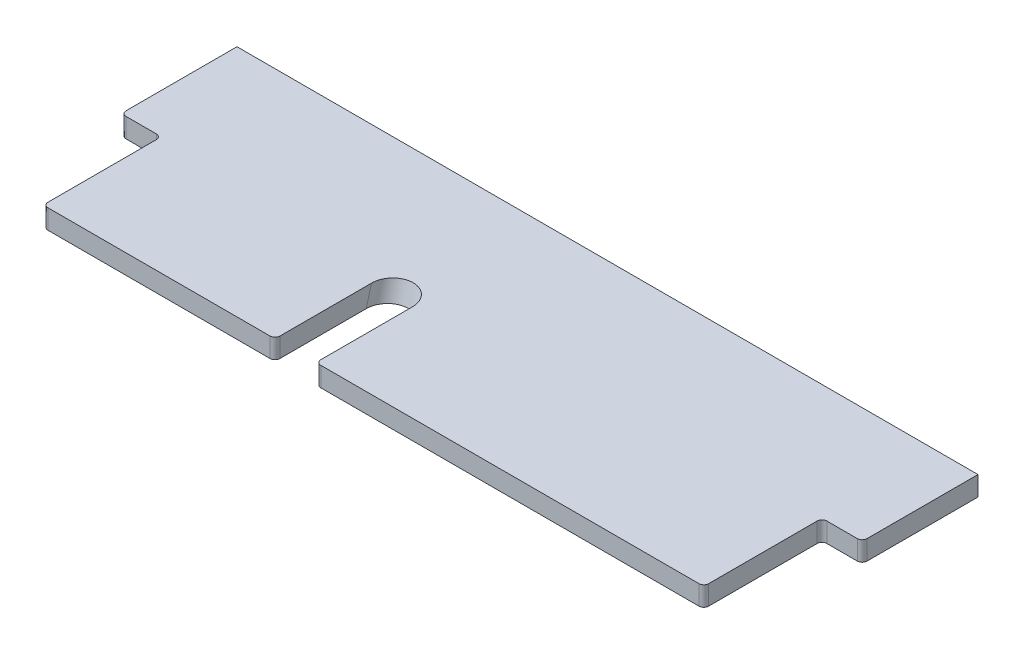
ISO-10303-21;
HEADER;
FILE_DESCRIPTION(('STEP AP214'),'2;1');
FILE_NAME('part.step','',(''),(''),'','','');
FILE_SCHEMA(('AUTOMOTIVE_DESIGN { 1 0 10303 214 1 1 1 1 }'));
ENDSEC;
DATA;
#1=APPLICATION_CONTEXT('core data for automotive mechanical design processes');
#2=APPLICATION_PROTOCOL_DEFINITION('international standard','automotive_design',2000,#1);
#3=PRODUCT_CONTEXT('',#1,'mechanical');
#4=PRODUCT('Part','Part','',(#3));
#5=PRODUCT_RELATED_PRODUCT_CATEGORY('part','',(#4));
#6=PRODUCT_DEFINITION_FORMATION('','',#4);
#7=PRODUCT_DEFINITION_CONTEXT('part definition',#1,'design');
#8=PRODUCT_DEFINITION('design','',#6,#7);
#9=PRODUCT_DEFINITION_SHAPE('','',#8);
#10=(LENGTH_UNIT() NAMED_UNIT(*) SI_UNIT(.MILLI.,.METRE.));
#11=(NAMED_UNIT(*) PLANE_ANGLE_UNIT() SI_UNIT($,.RADIAN.));
#12=(NAMED_UNIT(*) SI_UNIT($,.STERADIAN.) SOLID_ANGLE_UNIT());
#13=UNCERTAINTY_MEASURE_WITH_UNIT(LENGTH_MEASURE(1.E-05),#10,'distance_accuracy_value','');
#14=(GEOMETRIC_REPRESENTATION_CONTEXT(3) GLOBAL_UNCERTAINTY_ASSIGNED_CONTEXT((#13)) GLOBAL_UNIT_ASSIGNED_CONTEXT((#10,
#11,#12)) REPRESENTATION_CONTEXT('',''));
#15=CARTESIAN_POINT('',(0.,0.,0.));
#16=DIRECTION('',(0.,0.,1.));
#17=DIRECTION('',(1.,0.,0.));
#18=AXIS2_PLACEMENT_3D('',#15,#16,#17);
#19=CARTESIAN_POINT('',(-215.9,6.35,76.2));
#20=DIRECTION('',(0.,0.,-1.));
#21=DIRECTION('',(-1.,0.,0.));
#22=AXIS2_PLACEMENT_3D('',#19,#20,#21);
#23=PLANE('',#22);
#24=DIRECTION('',(1.,0.,0.));
#25=VECTOR('',#24,1.);
#26=CARTESIAN_POINT('',(-215.9,-6.35,76.2));
#27=LINE('',#26,#25);
#28=CARTESIAN_POINT('',(-211.963,-6.35,76.2));
#29=VERTEX_POINT('',#28);
#30=CARTESIAN_POINT('',(-67.31,-6.35,76.2));
#31=VERTEX_POINT('',#30);
#32=EDGE_CURVE('E289',#29,#31,#27,.T.);
#33=ORIENTED_EDGE('',*,*,#32,.T.);
#34=DIRECTION('',(0.,-1.,0.));
#35=VECTOR('',#34,1.);
#36=CARTESIAN_POINT('',(-67.31,6.35,76.2));
#37=LINE('',#36,#35);
#38=CARTESIAN_POINT('',(-67.31,6.35,76.2));
#39=VERTEX_POINT('',#38);
#40=EDGE_CURVE('E317',#31,#39,#37,.F.);
#41=ORIENTED_EDGE('',*,*,#40,.T.);
#42=DIRECTION('',(1.,0.,0.));
#43=VECTOR('',#42,1.);
#44=CARTESIAN_POINT('',(-215.9,6.35,76.2));
#45=LINE('',#44,#43);
#46=CARTESIAN_POINT('',(-211.963,6.35,76.2));
#47=VERTEX_POINT('',#46);
#48=EDGE_CURVE('E225',#47,#39,#45,.T.);
#49=ORIENTED_EDGE('',*,*,#48,.F.);
#50=DIRECTION('',(0.,-1.,0.));
#51=VECTOR('',#50,1.);
#52=CARTESIAN_POINT('',(-211.963,6.35,76.2));
#53=LINE('',#52,#51);
#54=EDGE_CURVE('E313',#47,#29,#53,.T.);
#55=ORIENTED_EDGE('',*,*,#54,.T.);
#56=EDGE_LOOP('',(#33,#41,#49,#55));
#57=FACE_BOUND('',#56,.T.);
#58=ADVANCED_FACE('F44',(#57),#23,.F.);
#59=CARTESIAN_POINT('',(215.138,6.35,0.));
#60=DIRECTION('',(-1.,0.,0.));
#61=DIRECTION('',(0.,0.,1.));
#62=AXIS2_PLACEMENT_3D('',#59,#60,#61);
#63=PLANE('',#62);
#64=DIRECTION('',(0.,0.,-1.));
#65=VECTOR('',#64,1.);
#66=CARTESIAN_POINT('',(215.138,-6.35,0.));
#67=LINE('',#66,#65);
#68=CARTESIAN_POINT('',(215.138,-6.35,73.025));
#69=VERTEX_POINT('',#68);
#70=CARTESIAN_POINT('',(215.138,-6.35,2.41300000000001));
#71=VERTEX_POINT('',#70);
#72=EDGE_CURVE('E237',#69,#71,#67,.T.);
#73=ORIENTED_EDGE('',*,*,#72,.T.);
#74=DIRECTION('',(0.,-1.,0.));
#75=VECTOR('',#74,1.);
#76=CARTESIAN_POINT('',(215.138,6.35,2.41300000000001));
#77=LINE('',#76,#75);
#78=CARTESIAN_POINT('',(215.138,6.35,2.41300000000001));
#79=VERTEX_POINT('',#78);
#80=EDGE_CURVE('E369',#71,#79,#77,.F.);
#81=ORIENTED_EDGE('',*,*,#80,.T.);
#82=DIRECTION('',(0.,0.,-1.));
#83=VECTOR('',#82,1.);
#84=CARTESIAN_POINT('',(215.138,6.35,0.));
#85=LINE('',#84,#83);
#86=CARTESIAN_POINT('',(215.138,6.35,73.025));
#87=VERTEX_POINT('',#86);
#88=EDGE_CURVE('E242',#87,#79,#85,.T.);
#89=ORIENTED_EDGE('',*,*,#88,.F.);
#90=DIRECTION('',(0.,-1.,0.));
#91=VECTOR('',#90,1.);
#92=CARTESIAN_POINT('',(215.138,6.35,73.025));
#93=LINE('',#92,#91);
#94=EDGE_CURVE('E365',#87,#69,#93,.T.);
#95=ORIENTED_EDGE('',*,*,#94,.T.);
#96=EDGE_LOOP('',(#73,#81,#89,#95));
#97=FACE_BOUND('',#96,.T.);
#98=ADVANCED_FACE('F425',(#97),#63,.F.);
#99=CARTESIAN_POINT('',(215.9,6.35,-0.761999999999986));
#100=DIRECTION('',(0.,0.,-1.));
#101=DIRECTION('',(-1.,0.,0.));
#102=AXIS2_PLACEMENT_3D('',#99,#100,#101);
#103=PLANE('',#102);
#104=DIRECTION('',(1.,0.,0.));
#105=VECTOR('',#104,1.);
#106=CARTESIAN_POINT('',(215.9,-6.35,-0.761999999999986));
#107=LINE('',#106,#105);
#108=CARTESIAN_POINT('',(218.313,-6.35,-0.761999999999986));
#109=VERTEX_POINT('',#108);
#110=CARTESIAN_POINT('',(238.125,-6.35,-0.761999999999986));
#111=VERTEX_POINT('',#110);
#112=EDGE_CURVE('E220',#109,#111,#107,.T.);
#113=ORIENTED_EDGE('',*,*,#112,.T.);
#114=DIRECTION('',(0.,-1.,0.));
#115=VECTOR('',#114,1.);
#116=CARTESIAN_POINT('',(238.125,6.35,-0.761999999999986));
#117=LINE('',#116,#115);
#118=CARTESIAN_POINT('',(238.125,6.35,-0.761999999999986));
#119=VERTEX_POINT('',#118);
#120=EDGE_CURVE('E362',#111,#119,#117,.F.);
#121=ORIENTED_EDGE('',*,*,#120,.T.);
#122=DIRECTION('',(1.,0.,0.));
#123=VECTOR('',#122,1.);
#124=CARTESIAN_POINT('',(215.9,6.35,-0.761999999999986));
#125=LINE('',#124,#123);
#126=CARTESIAN_POINT('',(218.313,6.35,-0.761999999999986));
#127=VERTEX_POINT('',#126);
#128=EDGE_CURVE('E236',#127,#119,#125,.T.);
#129=ORIENTED_EDGE('',*,*,#128,.F.);
#130=DIRECTION('',(0.,-1.,0.));
#131=VECTOR('',#130,1.);
#132=CARTESIAN_POINT('',(218.313,-6.35,-0.761999999999986));
#133=LINE('',#132,#131);
#134=EDGE_CURVE('E358',#127,#109,#133,.T.);
#135=ORIENTED_EDGE('',*,*,#134,.T.);
#136=EDGE_LOOP('',(#113,#121,#129,#135));
#137=FACE_BOUND('',#136,.T.);
#138=ADVANCED_FACE('F434',(#137),#103,.F.);
#139=CARTESIAN_POINT('',(241.3,6.35,-76.2));
#140=DIRECTION('',(-1.,0.,0.));
#141=DIRECTION('',(0.,0.,1.));
#142=AXIS2_PLACEMENT_3D('',#139,#140,#141);
#143=PLANE('',#142);
#144=DIRECTION('',(0.,0.,-1.));
#145=VECTOR('',#144,1.);
#146=CARTESIAN_POINT('',(241.3,6.35,-76.2));
#147=LINE('',#146,#145);
#148=CARTESIAN_POINT('',(241.3,6.35,-3.93700000000001));
#149=VERTEX_POINT('',#148);
#150=CARTESIAN_POINT('',(241.3,6.35,-76.2));
#151=VERTEX_POINT('',#150);
#152=EDGE_CURVE('E233',#149,#151,#147,.T.);
#153=ORIENTED_EDGE('',*,*,#152,.F.);
#154=DIRECTION('',(0.,-1.,0.));
#155=VECTOR('',#154,1.);
#156=CARTESIAN_POINT('',(241.3,6.35,-3.93699999999998));
#157=LINE('',#156,#155);
#158=CARTESIAN_POINT('',(241.3,-6.35,-3.93700000000001));
#159=VERTEX_POINT('',#158);
#160=EDGE_CURVE('E354',#149,#159,#157,.T.);
#161=ORIENTED_EDGE('',*,*,#160,.T.);
#162=DIRECTION('',(0.,0.,-1.));
#163=VECTOR('',#162,1.);
#164=CARTESIAN_POINT('',(241.3,-6.35,-76.2));
#165=LINE('',#164,#163);
#166=CARTESIAN_POINT('',(241.3,-6.35,-76.2));
#167=VERTEX_POINT('',#166);
#168=EDGE_CURVE('E195',#159,#167,#165,.T.);
#169=ORIENTED_EDGE('',*,*,#168,.T.);
#170=DIRECTION('',(0.,-1.,0.));
#171=VECTOR('',#170,1.);
#172=CARTESIAN_POINT('',(241.3,6.35,-76.2));
#173=LINE('',#172,#171);
#174=EDGE_CURVE('E190',#151,#167,#173,.T.);
#175=ORIENTED_EDGE('',*,*,#174,.F.);
#176=EDGE_LOOP('',(#153,#161,#169,#175));
#177=FACE_BOUND('',#176,.T.);
#178=ADVANCED_FACE('F442',(#177),#143,.F.);
#179=CARTESIAN_POINT('',(-215.9,6.35,-76.2));
#180=DIRECTION('',(0.,0.,1.));
#181=DIRECTION('',(1.,0.,0.));
#182=AXIS2_PLACEMENT_3D('',#179,#180,#181);
#183=PLANE('',#182);
#184=DIRECTION('',(-1.,0.,0.));
#185=VECTOR('',#184,1.);
#186=CARTESIAN_POINT('',(-215.9,-6.35,-76.2));
#187=LINE('',#186,#185);
#188=CARTESIAN_POINT('',(-241.3,-6.35,-76.2));
#189=VERTEX_POINT('',#188);
#190=EDGE_CURVE('E183',#167,#189,#187,.T.);
#191=ORIENTED_EDGE('',*,*,#190,.T.);
#192=DIRECTION('',(0.,-1.,0.));
#193=VECTOR('',#192,1.);
#194=CARTESIAN_POINT('',(-241.3,6.35,-76.2));
#195=LINE('',#194,#193);
#196=CARTESIAN_POINT('',(-241.3,6.35,-76.2));
#197=VERTEX_POINT('',#196);
#198=EDGE_CURVE('E187',#197,#189,#195,.T.);
#199=ORIENTED_EDGE('',*,*,#198,.F.);
#200=DIRECTION('',(-1.,0.,0.));
#201=VECTOR('',#200,1.);
#202=CARTESIAN_POINT('',(215.9,6.35,-76.2));
#203=LINE('',#202,#201);
#204=EDGE_CURVE('E230',#151,#197,#203,.T.);
#205=ORIENTED_EDGE('',*,*,#204,.F.);
#206=ORIENTED_EDGE('',*,*,#174,.T.);
#207=EDGE_LOOP('',(#191,#199,#205,#206));
#208=FACE_BOUND('',#207,.T.);
#209=ADVANCED_FACE('F185',(#208),#183,.F.);
#210=CARTESIAN_POINT('',(-241.3,6.35,-76.2));
#211=DIRECTION('',(1.,0.,0.));
#212=DIRECTION('',(0.,0.,-1.));
#213=AXIS2_PLACEMENT_3D('',#210,#211,#212);
#214=PLANE('',#213);
#215=DIRECTION('',(0.,0.,1.));
#216=VECTOR('',#215,1.);
#217=CARTESIAN_POINT('',(-241.3,-6.35,-76.2));
#218=LINE('',#217,#216);
#219=CARTESIAN_POINT('',(-241.3,-6.35,-3.93700000000001));
#220=VERTEX_POINT('',#219);
#221=EDGE_CURVE('E200',#189,#220,#218,.T.);
#222=ORIENTED_EDGE('',*,*,#221,.T.);
#223=DIRECTION('',(0.,-1.,0.));
#224=VECTOR('',#223,1.);
#225=CARTESIAN_POINT('',(-241.3,6.35,-3.93699999999998));
#226=LINE('',#225,#224);
#227=CARTESIAN_POINT('',(-241.3,6.35,-3.93700000000001));
#228=VERTEX_POINT('',#227);
#229=EDGE_CURVE('E351',#220,#228,#226,.F.);
#230=ORIENTED_EDGE('',*,*,#229,.T.);
#231=DIRECTION('',(0.,0.,1.));
#232=VECTOR('',#231,1.);
#233=CARTESIAN_POINT('',(-241.3,6.35,-76.2));
#234=LINE('',#233,#232);
#235=EDGE_CURVE('E203',#197,#228,#234,.T.);
#236=ORIENTED_EDGE('',*,*,#235,.F.);
#237=ORIENTED_EDGE('',*,*,#198,.T.);
#238=EDGE_LOOP('',(#222,#230,#236,#237));
#239=FACE_BOUND('',#238,.T.);
#240=ADVANCED_FACE('F199',(#239),#214,.F.);
#241=CARTESIAN_POINT('',(-215.9,6.35,-0.76199999999999));
#242=DIRECTION('',(0.,0.,-1.));
#243=DIRECTION('',(-1.,0.,0.));
#244=AXIS2_PLACEMENT_3D('',#241,#242,#243);
#245=PLANE('',#244);
#246=DIRECTION('',(1.,0.,0.));
#247=VECTOR('',#246,1.);
#248=CARTESIAN_POINT('',(-215.9,6.35,-0.76199999999999));
#249=LINE('',#248,#247);
#250=CARTESIAN_POINT('',(-238.125,6.35,-0.761999999999987));
#251=VERTEX_POINT('',#250);
#252=CARTESIAN_POINT('',(-218.313,6.35,-0.761999999999989));
#253=VERTEX_POINT('',#252);
#254=EDGE_CURVE('E229',#251,#253,#249,.T.);
#255=ORIENTED_EDGE('',*,*,#254,.F.);
#256=DIRECTION('',(0.,-1.,0.));
#257=VECTOR('',#256,1.);
#258=CARTESIAN_POINT('',(-238.125,6.35,-0.761999999999987));
#259=LINE('',#258,#257);
#260=CARTESIAN_POINT('',(-238.125,-6.35,-0.761999999999987));
#261=VERTEX_POINT('',#260);
#262=EDGE_CURVE('E347',#251,#261,#259,.T.);
#263=ORIENTED_EDGE('',*,*,#262,.T.);
#264=DIRECTION('',(1.,0.,0.));
#265=VECTOR('',#264,1.);
#266=CARTESIAN_POINT('',(-215.9,-6.35,-0.76199999999999));
#267=LINE('',#266,#265);
#268=CARTESIAN_POINT('',(-218.313,-6.35,-0.761999999999989));
#269=VERTEX_POINT('',#268);
#270=EDGE_CURVE('E205',#261,#269,#267,.T.);
#271=ORIENTED_EDGE('',*,*,#270,.T.);
#272=DIRECTION('',(0.,-1.,0.));
#273=VECTOR('',#272,1.);
#274=CARTESIAN_POINT('',(-218.313,6.35,-0.761999999999989));
#275=LINE('',#274,#273);
#276=EDGE_CURVE('E344',#269,#253,#275,.F.);
#277=ORIENTED_EDGE('',*,*,#276,.T.);
#278=EDGE_LOOP('',(#255,#263,#271,#277));
#279=FACE_BOUND('',#278,.T.);
#280=ADVANCED_FACE('F394',(#279),#245,.F.);
#281=CARTESIAN_POINT('',(-215.138,6.35,0.));
#282=DIRECTION('',(1.,0.,0.));
#283=DIRECTION('',(0.,0.,-1.));
#284=AXIS2_PLACEMENT_3D('',#281,#282,#283);
#285=PLANE('',#284);
#286=DIRECTION('',(0.,0.,1.));
#287=VECTOR('',#286,1.);
#288=CARTESIAN_POINT('',(-215.138,-6.35,0.));
#289=LINE('',#288,#287);
#290=CARTESIAN_POINT('',(-215.138,-6.35,2.41300000000001));
#291=VERTEX_POINT('',#290);
#292=CARTESIAN_POINT('',(-215.138,-6.35,73.025));
#293=VERTEX_POINT('',#292);
#294=EDGE_CURVE('E253',#291,#293,#289,.T.);
#295=ORIENTED_EDGE('',*,*,#294,.T.);
#296=DIRECTION('',(0.,-1.,0.));
#297=VECTOR('',#296,1.);
#298=CARTESIAN_POINT('',(-215.138,6.35,73.025));
#299=LINE('',#298,#297);
#300=CARTESIAN_POINT('',(-215.138,6.35,73.025));
#301=VERTEX_POINT('',#300);
#302=EDGE_CURVE('E60',#293,#301,#299,.F.);
#303=ORIENTED_EDGE('',*,*,#302,.T.);
#304=DIRECTION('',(0.,0.,1.));
#305=VECTOR('',#304,1.);
#306=CARTESIAN_POINT('',(-215.138,6.35,0.));
#307=LINE('',#306,#305);
#308=CARTESIAN_POINT('',(-215.138,6.35,2.41300000000001));
#309=VERTEX_POINT('',#308);
#310=EDGE_CURVE('E226',#309,#301,#307,.T.);
#311=ORIENTED_EDGE('',*,*,#310,.F.);
#312=DIRECTION('',(0.,-1.,0.));
#313=VECTOR('',#312,1.);
#314=CARTESIAN_POINT('',(-215.138,-6.35,2.41300000000001));
#315=LINE('',#314,#313);
#316=EDGE_CURVE('E338',#309,#291,#315,.T.);
#317=ORIENTED_EDGE('',*,*,#316,.T.);
#318=EDGE_LOOP('',(#295,#303,#311,#317));
#319=FACE_BOUND('',#318,.T.);
#320=ADVANCED_FACE('F396',(#319),#285,.F.);
#321=CARTESIAN_POINT('',(-34.2899999999998,-6.35,76.2));
#322=VERTEX_POINT('',#321);
#323=CARTESIAN_POINT('',(211.963,-6.35,76.2));
#324=VERTEX_POINT('',#323);
#325=EDGE_CURVE('E216',#322,#324,#27,.T.);
#326=ORIENTED_EDGE('',*,*,#325,.T.);
#327=DIRECTION('',(0.,-1.,0.));
#328=VECTOR('',#327,1.);
#329=CARTESIAN_POINT('',(211.963,6.35,76.2));
#330=LINE('',#329,#328);
#331=CARTESIAN_POINT('',(211.963,6.35,76.2));
#332=VERTEX_POINT('',#331);
#333=EDGE_CURVE('E375',#324,#332,#330,.F.);
#334=ORIENTED_EDGE('',*,*,#333,.T.);
#335=CARTESIAN_POINT('',(-34.2899999999998,6.35,76.2));
#336=VERTEX_POINT('',#335);
#337=EDGE_CURVE('E221',#336,#332,#45,.T.);
#338=ORIENTED_EDGE('',*,*,#337,.F.);
#339=DIRECTION('',(0.,1.,0.));
#340=VECTOR('',#339,1.);
#341=CARTESIAN_POINT('',(-34.2899999999998,6.3500000000001,76.2));
#342=LINE('',#341,#340);
#343=EDGE_CURVE('E372',#336,#322,#342,.F.);
#344=ORIENTED_EDGE('',*,*,#343,.T.);
#345=EDGE_LOOP('',(#326,#334,#338,#344));
#346=FACE_BOUND('',#345,.T.);
#347=ADVANCED_FACE('F414',(#346),#23,.F.);
#348=CARTESIAN_POINT('',(0.,6.35,0.));
#349=DIRECTION('',(0.,1.,0.));
#350=DIRECTION('',(0.,0.,1.));
#351=AXIS2_PLACEMENT_3D('',#348,#349,#350);
#352=PLANE('',#351);
#353=ORIENTED_EDGE('',*,*,#48,.T.);
#354=CARTESIAN_POINT('',(-67.31,6.35,73.025));
#355=DIRECTION('',(0.,1.,0.));
#356=DIRECTION('',(0.,0.,1.));
#357=AXIS2_PLACEMENT_3D('',#354,#355,#356);
#358=CIRCLE('',#357,3.175);
#359=CARTESIAN_POINT('',(-64.135,6.35,73.025));
#360=VERTEX_POINT('',#359);
#361=EDGE_CURVE('E335',#39,#360,#358,.T.);
#362=ORIENTED_EDGE('',*,*,#361,.T.);
#363=DIRECTION('',(0.,0.,1.));
#364=VECTOR('',#363,1.);
#365=CARTESIAN_POINT('',(-64.135,6.35,0.));
#366=LINE('',#365,#364);
#367=CARTESIAN_POINT('',(-64.135,6.34999999999999,13.3639769330719));
#368=VERTEX_POINT('',#367);
#369=EDGE_CURVE('E265',#368,#360,#366,.T.);
#370=ORIENTED_EDGE('',*,*,#369,.F.);
#371=CARTESIAN_POINT('',(-50.7999999999986,6.34999999999999,13.3639769330719));
#372=DIRECTION('',(0.,1.,0.));
#373=DIRECTION('',(0.,0.,-1.));
#374=AXIS2_PLACEMENT_3D('',#371,#372,#373);
#375=ELLIPSE('',#374,13.8160367727838,13.3350000000001);
#376=CARTESIAN_POINT('',(-37.4649999999998,6.34999999999999,13.3639769330719));
#377=VERTEX_POINT('',#376);
#378=EDGE_CURVE('E246',#368,#377,#375,.F.);
#379=ORIENTED_EDGE('',*,*,#378,.T.);
#380=DIRECTION('',(0.,0.,1.));
#381=VECTOR('',#380,1.);
#382=CARTESIAN_POINT('',(-37.4649999999998,6.35,-76.201));
#383=LINE('',#382,#381);
#384=CARTESIAN_POINT('',(-37.4649999999998,6.35,73.025));
#385=VERTEX_POINT('',#384);
#386=EDGE_CURVE('E275',#377,#385,#383,.T.);
#387=ORIENTED_EDGE('',*,*,#386,.T.);
#388=CARTESIAN_POINT('',(-34.2899999999998,6.35,73.025));
#389=DIRECTION('',(0.,1.,0.));
#390=DIRECTION('',(0.,0.,1.));
#391=AXIS2_PLACEMENT_3D('',#388,#389,#390);
#392=CIRCLE('',#391,3.175);
#393=EDGE_CURVE('E320',#385,#336,#392,.T.);
#394=ORIENTED_EDGE('',*,*,#393,.T.);
#395=ORIENTED_EDGE('',*,*,#337,.T.);
#396=CARTESIAN_POINT('',(211.963,6.35,73.025));
#397=DIRECTION('',(0.,1.,0.));
#398=DIRECTION('',(0.,0.,1.));
#399=AXIS2_PLACEMENT_3D('',#396,#397,#398);
#400=CIRCLE('',#399,3.175);
#401=EDGE_CURVE('E323',#332,#87,#400,.T.);
#402=ORIENTED_EDGE('',*,*,#401,.T.);
#403=ORIENTED_EDGE('',*,*,#88,.T.);
#404=CARTESIAN_POINT('',(218.313,6.35,2.41300000000001));
#405=DIRECTION('',(0.,1.,0.));
#406=DIRECTION('',(0.,0.,1.));
#407=AXIS2_PLACEMENT_3D('',#404,#405,#406);
#408=CIRCLE('',#407,3.175);
#409=EDGE_CURVE('E385',#79,#127,#408,.F.);
#410=ORIENTED_EDGE('',*,*,#409,.T.);
#411=ORIENTED_EDGE('',*,*,#128,.T.);
#412=CARTESIAN_POINT('',(238.125,6.35,-3.93699999999998));
#413=DIRECTION('',(0.,1.,0.));
#414=DIRECTION('',(0.,0.,1.));
#415=AXIS2_PLACEMENT_3D('',#412,#413,#414);
#416=CIRCLE('',#415,3.175);
#417=EDGE_CURVE('E326',#119,#149,#416,.T.);
#418=ORIENTED_EDGE('',*,*,#417,.T.);
#419=ORIENTED_EDGE('',*,*,#152,.T.);
#420=ORIENTED_EDGE('',*,*,#204,.T.);
#421=ORIENTED_EDGE('',*,*,#235,.T.);
#422=CARTESIAN_POINT('',(-238.125,6.35,-3.93699999999999));
#423=DIRECTION('',(0.,1.,0.));
#424=DIRECTION('',(0.,0.,1.));
#425=AXIS2_PLACEMENT_3D('',#422,#423,#424);
#426=CIRCLE('',#425,3.175);
#427=EDGE_CURVE('E329',#228,#251,#426,.T.);
#428=ORIENTED_EDGE('',*,*,#427,.T.);
#429=ORIENTED_EDGE('',*,*,#254,.T.);
#430=CARTESIAN_POINT('',(-218.313,6.35,2.41300000000001));
#431=DIRECTION('',(0.,1.,0.));
#432=DIRECTION('',(0.,0.,1.));
#433=AXIS2_PLACEMENT_3D('',#430,#431,#432);
#434=CIRCLE('',#433,3.175);
#435=EDGE_CURVE('E12',#253,#309,#434,.F.);
#436=ORIENTED_EDGE('',*,*,#435,.T.);
#437=ORIENTED_EDGE('',*,*,#310,.T.);
#438=CARTESIAN_POINT('',(-211.963,6.35,73.025));
#439=DIRECTION('',(0.,1.,0.));
#440=DIRECTION('',(0.,0.,1.));
#441=AXIS2_PLACEMENT_3D('',#438,#439,#440);
#442=CIRCLE('',#441,3.175);
#443=EDGE_CURVE('E332',#301,#47,#442,.T.);
#444=ORIENTED_EDGE('',*,*,#443,.T.);
#445=EDGE_LOOP('',(#353,#362,#370,#379,#387,#394,#395,#402,#403,#410,#411,#418,#419,#420,#421,
#428,#429,#436,#437,#444));
#446=FACE_BOUND('',#445,.T.);
#447=ADVANCED_FACE('F399',(#446),#352,.T.);
#448=CARTESIAN_POINT('',(0.,-6.35,0.));
#449=DIRECTION('',(0.,1.,0.));
#450=DIRECTION('',(0.,0.,1.));
#451=AXIS2_PLACEMENT_3D('',#448,#449,#450);
#452=PLANE('',#451);
#453=DIRECTION('',(0.,0.,1.));
#454=VECTOR('',#453,1.);
#455=CARTESIAN_POINT('',(-64.135,-6.35,0.));
#456=LINE('',#455,#454);
#457=CARTESIAN_POINT('',(-64.135,-6.34999999999999,16.8058357235667));
#458=VERTEX_POINT('',#457);
#459=CARTESIAN_POINT('',(-64.135,-6.35,73.025));
#460=VERTEX_POINT('',#459);
#461=EDGE_CURVE('E270',#458,#460,#456,.T.);
#462=ORIENTED_EDGE('',*,*,#461,.T.);
#463=CARTESIAN_POINT('',(-67.31,-6.35,73.025));
#464=DIRECTION('',(0.,1.,0.));
#465=DIRECTION('',(0.,0.,1.));
#466=AXIS2_PLACEMENT_3D('',#463,#464,#465);
#467=CIRCLE('',#466,3.175);
#468=EDGE_CURVE('E310',#460,#31,#467,.F.);
#469=ORIENTED_EDGE('',*,*,#468,.T.);
#470=ORIENTED_EDGE('',*,*,#32,.F.);
#471=CARTESIAN_POINT('',(-211.963,-6.35,73.025));
#472=DIRECTION('',(0.,1.,0.));
#473=DIRECTION('',(0.,0.,1.));
#474=AXIS2_PLACEMENT_3D('',#471,#472,#473);
#475=CIRCLE('',#474,3.175);
#476=EDGE_CURVE('E307',#29,#293,#475,.F.);
#477=ORIENTED_EDGE('',*,*,#476,.T.);
#478=ORIENTED_EDGE('',*,*,#294,.F.);
#479=CARTESIAN_POINT('',(-218.313,-6.35,2.41300000000001));
#480=DIRECTION('',(0.,1.,0.));
#481=DIRECTION('',(0.,0.,1.));
#482=AXIS2_PLACEMENT_3D('',#479,#480,#481);
#483=CIRCLE('',#482,3.175);
#484=EDGE_CURVE('E53',#291,#269,#483,.T.);
#485=ORIENTED_EDGE('',*,*,#484,.T.);
#486=ORIENTED_EDGE('',*,*,#270,.F.);
#487=CARTESIAN_POINT('',(-238.125,-6.35,-3.93699999999999));
#488=DIRECTION('',(0.,1.,0.));
#489=DIRECTION('',(0.,0.,1.));
#490=AXIS2_PLACEMENT_3D('',#487,#488,#489);
#491=CIRCLE('',#490,3.175);
#492=EDGE_CURVE('E210',#261,#220,#491,.F.);
#493=ORIENTED_EDGE('',*,*,#492,.T.);
#494=ORIENTED_EDGE('',*,*,#221,.F.);
#495=ORIENTED_EDGE('',*,*,#190,.F.);
#496=ORIENTED_EDGE('',*,*,#168,.F.);
#497=CARTESIAN_POINT('',(238.125,-6.35,-3.93699999999998));
#498=DIRECTION('',(0.,1.,0.));
#499=DIRECTION('',(0.,0.,1.));
#500=AXIS2_PLACEMENT_3D('',#497,#498,#499);
#501=CIRCLE('',#500,3.175);
#502=EDGE_CURVE('E302',#159,#111,#501,.F.);
#503=ORIENTED_EDGE('',*,*,#502,.T.);
#504=ORIENTED_EDGE('',*,*,#112,.F.);
#505=CARTESIAN_POINT('',(218.313,-6.35,2.41300000000001));
#506=DIRECTION('',(0.,1.,0.));
#507=DIRECTION('',(0.,0.,1.));
#508=AXIS2_PLACEMENT_3D('',#505,#506,#507);
#509=CIRCLE('',#508,3.175);
#510=EDGE_CURVE('E382',#109,#71,#509,.T.);
#511=ORIENTED_EDGE('',*,*,#510,.T.);
#512=ORIENTED_EDGE('',*,*,#72,.F.);
#513=CARTESIAN_POINT('',(211.963,-6.35,73.025));
#514=DIRECTION('',(0.,1.,0.));
#515=DIRECTION('',(0.,0.,1.));
#516=AXIS2_PLACEMENT_3D('',#513,#514,#515);
#517=CIRCLE('',#516,3.175);
#518=EDGE_CURVE('E299',#69,#324,#517,.F.);
#519=ORIENTED_EDGE('',*,*,#518,.T.);
#520=ORIENTED_EDGE('',*,*,#325,.F.);
#521=CARTESIAN_POINT('',(-34.2899999999998,-6.35,73.025));
#522=DIRECTION('',(0.,1.,0.));
#523=DIRECTION('',(0.,0.,1.));
#524=AXIS2_PLACEMENT_3D('',#521,#522,#523);
#525=CIRCLE('',#524,3.175);
#526=CARTESIAN_POINT('',(-37.4649999999998,-6.35,73.025));
#527=VERTEX_POINT('',#526);
#528=EDGE_CURVE('E296',#322,#527,#525,.F.);
#529=ORIENTED_EDGE('',*,*,#528,.T.);
#530=DIRECTION('',(0.,0.,1.));
#531=VECTOR('',#530,1.);
#532=CARTESIAN_POINT('',(-37.4649999999998,-6.35,-76.201));
#533=LINE('',#532,#531);
#534=CARTESIAN_POINT('',(-37.4649999999998,-6.34999999999999,16.8058357235667));
#535=VERTEX_POINT('',#534);
#536=EDGE_CURVE('E271',#535,#527,#533,.T.);
#537=ORIENTED_EDGE('',*,*,#536,.F.);
#538=CARTESIAN_POINT('',(-50.7999999999986,-6.34999999999999,16.8058357235667));
#539=DIRECTION('',(0.,1.,0.));
#540=DIRECTION('',(0.,0.,-1.));
#541=AXIS2_PLACEMENT_3D('',#538,#539,#540);
#542=ELLIPSE('',#541,13.8160367727838,13.3350000000001);
#543=EDGE_CURVE('E276',#458,#535,#542,.F.);
#544=ORIENTED_EDGE('',*,*,#543,.F.);
#545=EDGE_LOOP('',(#462,#469,#470,#477,#478,#485,#486,#493,#494,#495,#496,#503,#504,#511,#512,
#519,#520,#529,#537,#544));
#546=FACE_BOUND('',#545,.T.);
#547=ADVANCED_FACE('F208',(#546),#452,.F.);
#548=CARTESIAN_POINT('',(-50.7999999999986,-171.450000000005,61.5499999999998));
#549=DIRECTION('',(0.,0.965182723476006,-0.261576585923588));
#550=DIRECTION('',(0.,-0.261576585923588,-0.965182723476006));
#551=AXIS2_PLACEMENT_3D('',#548,#549,#550);
#552=CYLINDRICAL_SURFACE('',#551,13.3350000000001);
#553=DIRECTION('',(0.,0.965182723476006,-0.261576585923588));
#554=VECTOR('',#553,1.);
#555=CARTESIAN_POINT('',(-64.1349999999987,-171.450000000005,61.5499999999998));
#556=LINE('',#555,#554);
#557=EDGE_CURVE('E266',#368,#458,#556,.F.);
#558=ORIENTED_EDGE('',*,*,#557,.T.);
#559=ORIENTED_EDGE('',*,*,#543,.T.);
#560=DIRECTION('',(0.,0.965182723476006,-0.261576585923588));
#561=VECTOR('',#560,1.);
#562=CARTESIAN_POINT('',(-37.4649999999985,-171.450000000005,61.5499999999998));
#563=LINE('',#562,#561);
#564=EDGE_CURVE('E241',#377,#535,#563,.F.);
#565=ORIENTED_EDGE('',*,*,#564,.F.);
#566=ORIENTED_EDGE('',*,*,#378,.F.);
#567=EDGE_LOOP('',(#558,#559,#565,#566));
#568=FACE_BOUND('',#567,.T.);
#569=ADVANCED_FACE('F480',(#568),#552,.F.);
#570=CARTESIAN_POINT('',(-37.4649999999998,6.34999999999999,-76.201));
#571=DIRECTION('',(1.,0.,0.));
#572=DIRECTION('',(0.,1.,0.));
#573=AXIS2_PLACEMENT_3D('',#570,#571,#572);
#574=PLANE('',#573);
#575=ORIENTED_EDGE('',*,*,#536,.T.);
#576=DIRECTION('',(0.,1.,0.));
#577=VECTOR('',#576,1.);
#578=CARTESIAN_POINT('',(-37.4649999999998,6.34999999999999,73.025));
#579=LINE('',#578,#577);
#580=EDGE_CURVE('E378',#527,#385,#579,.T.);
#581=ORIENTED_EDGE('',*,*,#580,.T.);
#582=ORIENTED_EDGE('',*,*,#386,.F.);
#583=ORIENTED_EDGE('',*,*,#564,.T.);
#584=EDGE_LOOP('',(#575,#581,#582,#583));
#585=FACE_BOUND('',#584,.T.);
#586=ADVANCED_FACE('F476',(#585),#574,.F.);
#587=CARTESIAN_POINT('',(-64.135,6.34999999999999,-76.201));
#588=DIRECTION('',(-1.,0.,0.));
#589=DIRECTION('',(0.,0.,1.));
#590=AXIS2_PLACEMENT_3D('',#587,#588,#589);
#591=PLANE('',#590);
#592=ORIENTED_EDGE('',*,*,#369,.T.);
#593=DIRECTION('',(0.,-1.,0.));
#594=VECTOR('',#593,1.);
#595=CARTESIAN_POINT('',(-64.135,6.34999999999999,73.025));
#596=LINE('',#595,#594);
#597=EDGE_CURVE('E280',#360,#460,#596,.T.);
#598=ORIENTED_EDGE('',*,*,#597,.T.);
#599=ORIENTED_EDGE('',*,*,#461,.F.);
#600=ORIENTED_EDGE('',*,*,#557,.F.);
#601=EDGE_LOOP('',(#592,#598,#599,#600));
#602=FACE_BOUND('',#601,.T.);
#603=ADVANCED_FACE('F479',(#602),#591,.F.);
#604=CARTESIAN_POINT('',(-67.31,6.34999999999999,73.025));
#605=DIRECTION('',(0.,-1.,0.));
#606=DIRECTION('',(0.,0.,-1.));
#607=AXIS2_PLACEMENT_3D('',#604,#605,#606);
#608=CYLINDRICAL_SURFACE('',#607,3.175);
#609=ORIENTED_EDGE('',*,*,#361,.F.);
#610=ORIENTED_EDGE('',*,*,#40,.F.);
#611=ORIENTED_EDGE('',*,*,#468,.F.);
#612=ORIENTED_EDGE('',*,*,#597,.F.);
#613=EDGE_LOOP('',(#609,#610,#611,#612));
#614=FACE_BOUND('',#613,.T.);
#615=ADVANCED_FACE('F453',(#614),#608,.T.);
#616=CARTESIAN_POINT('',(-211.963,6.35,73.025));
#617=DIRECTION('',(0.,-1.,0.));
#618=DIRECTION('',(0.,0.,-1.));
#619=AXIS2_PLACEMENT_3D('',#616,#617,#618);
#620=CYLINDRICAL_SURFACE('',#619,3.175);
#621=ORIENTED_EDGE('',*,*,#443,.F.);
#622=ORIENTED_EDGE('',*,*,#302,.F.);
#623=ORIENTED_EDGE('',*,*,#476,.F.);
#624=ORIENTED_EDGE('',*,*,#54,.F.);
#625=EDGE_LOOP('',(#621,#622,#623,#624));
#626=FACE_BOUND('',#625,.T.);
#627=ADVANCED_FACE('F403',(#626),#620,.T.);
#628=CARTESIAN_POINT('',(-238.125,6.35,-3.93699999999999));
#629=DIRECTION('',(0.,-1.,0.));
#630=DIRECTION('',(0.,0.,-1.));
#631=AXIS2_PLACEMENT_3D('',#628,#629,#630);
#632=CYLINDRICAL_SURFACE('',#631,3.175);
#633=ORIENTED_EDGE('',*,*,#427,.F.);
#634=ORIENTED_EDGE('',*,*,#229,.F.);
#635=ORIENTED_EDGE('',*,*,#492,.F.);
#636=ORIENTED_EDGE('',*,*,#262,.F.);
#637=EDGE_LOOP('',(#633,#634,#635,#636));
#638=FACE_BOUND('',#637,.T.);
#639=ADVANCED_FACE('F445',(#638),#632,.T.);
#640=CARTESIAN_POINT('',(238.125,6.35,-3.93699999999998));
#641=DIRECTION('',(0.,-1.,0.));
#642=DIRECTION('',(0.,0.,-1.));
#643=AXIS2_PLACEMENT_3D('',#640,#641,#642);
#644=CYLINDRICAL_SURFACE('',#643,3.175);
#645=ORIENTED_EDGE('',*,*,#417,.F.);
#646=ORIENTED_EDGE('',*,*,#120,.F.);
#647=ORIENTED_EDGE('',*,*,#502,.F.);
#648=ORIENTED_EDGE('',*,*,#160,.F.);
#649=EDGE_LOOP('',(#645,#646,#647,#648));
#650=FACE_BOUND('',#649,.T.);
#651=ADVANCED_FACE('F438',(#650),#644,.T.);
#652=CARTESIAN_POINT('',(218.313,6.35,2.41300000000001));
#653=DIRECTION('',(0.,1.,0.));
#654=DIRECTION('',(0.,0.,1.));
#655=AXIS2_PLACEMENT_3D('',#652,#653,#654);
#656=CYLINDRICAL_SURFACE('',#655,3.175);
#657=ORIENTED_EDGE('',*,*,#409,.F.);
#658=ORIENTED_EDGE('',*,*,#80,.F.);
#659=ORIENTED_EDGE('',*,*,#510,.F.);
#660=ORIENTED_EDGE('',*,*,#134,.F.);
#661=EDGE_LOOP('',(#657,#658,#659,#660));
#662=FACE_BOUND('',#661,.T.);
#663=ADVANCED_FACE('F429',(#662),#656,.F.);
#664=CARTESIAN_POINT('',(211.963,6.35,73.025));
#665=DIRECTION('',(0.,-1.,0.));
#666=DIRECTION('',(0.,0.,-1.));
#667=AXIS2_PLACEMENT_3D('',#664,#665,#666);
#668=CYLINDRICAL_SURFACE('',#667,3.175);
#669=ORIENTED_EDGE('',*,*,#401,.F.);
#670=ORIENTED_EDGE('',*,*,#333,.F.);
#671=ORIENTED_EDGE('',*,*,#518,.F.);
#672=ORIENTED_EDGE('',*,*,#94,.F.);
#673=EDGE_LOOP('',(#669,#670,#671,#672));
#674=FACE_BOUND('',#673,.T.);
#675=ADVANCED_FACE('F420',(#674),#668,.T.);
#676=CARTESIAN_POINT('',(-34.2899999999998,6.35,73.025));
#677=DIRECTION('',(0.,1.,0.));
#678=DIRECTION('',(-1.,0.,0.));
#679=AXIS2_PLACEMENT_3D('',#676,#677,#678);
#680=CYLINDRICAL_SURFACE('',#679,3.175);
#681=ORIENTED_EDGE('',*,*,#528,.F.);
#682=ORIENTED_EDGE('',*,*,#343,.F.);
#683=ORIENTED_EDGE('',*,*,#393,.F.);
#684=ORIENTED_EDGE('',*,*,#580,.F.);
#685=EDGE_LOOP('',(#681,#682,#683,#684));
#686=FACE_BOUND('',#685,.T.);
#687=ADVANCED_FACE('F501',(#686),#680,.T.);
#688=CARTESIAN_POINT('',(-218.313,6.35,2.41300000000001));
#689=DIRECTION('',(0.,1.,0.));
#690=DIRECTION('',(0.,0.,1.));
#691=AXIS2_PLACEMENT_3D('',#688,#689,#690);
#692=CYLINDRICAL_SURFACE('',#691,3.175);
#693=ORIENTED_EDGE('',*,*,#435,.F.);
#694=ORIENTED_EDGE('',*,*,#276,.F.);
#695=ORIENTED_EDGE('',*,*,#484,.F.);
#696=ORIENTED_EDGE('',*,*,#316,.F.);
#697=EDGE_LOOP('',(#693,#694,#695,#696));
#698=FACE_BOUND('',#697,.T.);
#699=ADVANCED_FACE('F46',(#698),#692,.F.);
#700=CLOSED_SHELL('',(#58,#98,#138,#178,#209,#240,#280,#320,#347,#447,#547,#569,#586,#603,#615,
#627,#639,#651,#663,#675,#687,#699));
#701=MANIFOLD_SOLID_BREP('B2',#700);
#702=ADVANCED_BREP_SHAPE_REPRESENTATION('',(#18,#701),#14);
#703=SHAPE_DEFINITION_REPRESENTATION(#9,#702);
ENDSEC;
END-ISO-10303-21;
